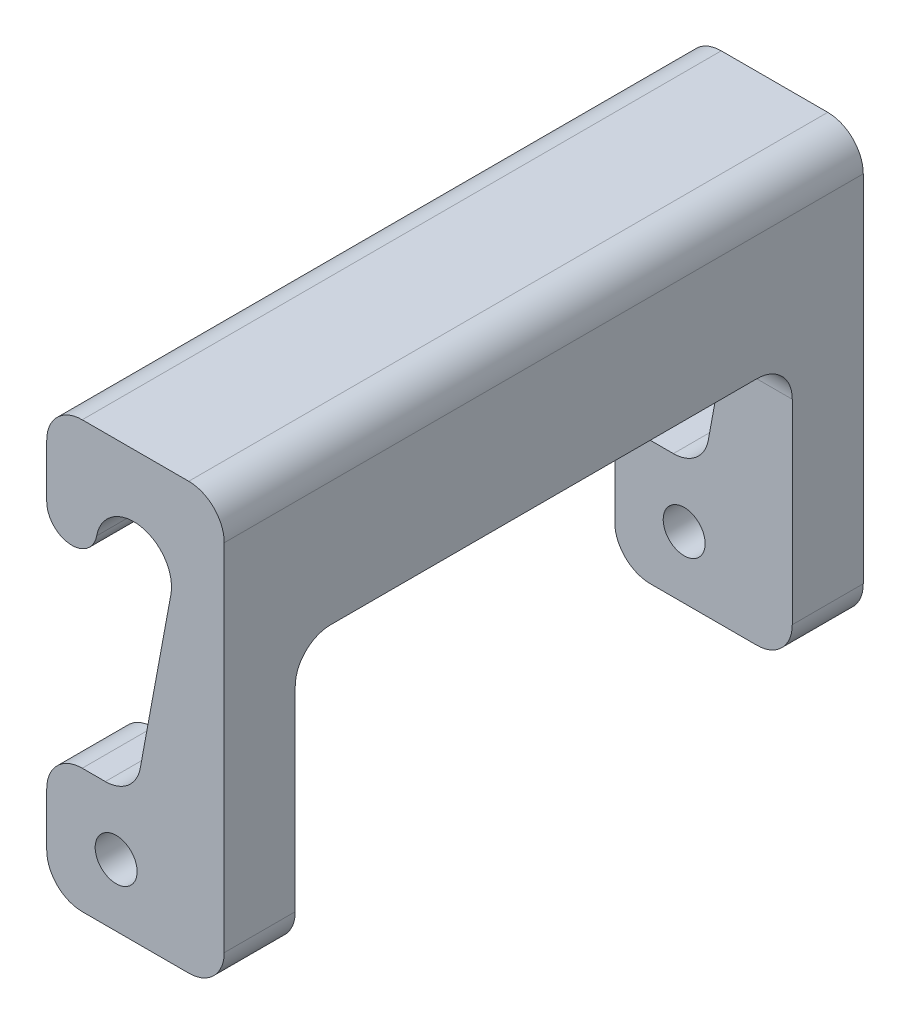
ISO-10303-21;
HEADER;
FILE_DESCRIPTION(('STEP AP214'),'2;1');
FILE_NAME('part.step','',(''),(''),'','','');
FILE_SCHEMA(('AUTOMOTIVE_DESIGN { 1 0 10303 214 1 1 1 1 }'));
ENDSEC;
DATA;
#1=APPLICATION_CONTEXT('core data for automotive mechanical design processes');
#2=APPLICATION_PROTOCOL_DEFINITION('international standard','automotive_design',2000,#1);
#3=PRODUCT_CONTEXT('',#1,'mechanical');
#4=PRODUCT('Part','Part','',(#3));
#5=PRODUCT_RELATED_PRODUCT_CATEGORY('part','',(#4));
#6=PRODUCT_DEFINITION_FORMATION('','',#4);
#7=PRODUCT_DEFINITION_CONTEXT('part definition',#1,'design');
#8=PRODUCT_DEFINITION('design','',#6,#7);
#9=PRODUCT_DEFINITION_SHAPE('','',#8);
#10=(LENGTH_UNIT() NAMED_UNIT(*) SI_UNIT(.MILLI.,.METRE.));
#11=(NAMED_UNIT(*) PLANE_ANGLE_UNIT() SI_UNIT($,.RADIAN.));
#12=(NAMED_UNIT(*) SI_UNIT($,.STERADIAN.) SOLID_ANGLE_UNIT());
#13=UNCERTAINTY_MEASURE_WITH_UNIT(LENGTH_MEASURE(1.E-05),#10,'distance_accuracy_value','');
#14=(GEOMETRIC_REPRESENTATION_CONTEXT(3) GLOBAL_UNCERTAINTY_ASSIGNED_CONTEXT((#13)) GLOBAL_UNIT_ASSIGNED_CONTEXT((#10,
#11,#12)) REPRESENTATION_CONTEXT('',''));
#15=CARTESIAN_POINT('',(0.,0.,0.));
#16=DIRECTION('',(0.,0.,1.));
#17=DIRECTION('',(1.,0.,0.));
#18=AXIS2_PLACEMENT_3D('',#15,#16,#17);
#19=CARTESIAN_POINT('',(0.,8.89,45.72));
#20=DIRECTION('',(0.,-1.,0.));
#21=DIRECTION('',(0.,0.,-1.));
#22=AXIS2_PLACEMENT_3D('',#19,#20,#21);
#23=PLANE('',#22);
#24=DIRECTION('',(0.,0.,-1.));
#25=VECTOR('',#24,1.);
#26=CARTESIAN_POINT('',(4.19391314965813,8.89,45.72));
#27=LINE('',#26,#25);
#28=CARTESIAN_POINT('',(4.19391314965813,8.89,45.72));
#29=VERTEX_POINT('',#28);
#30=CARTESIAN_POINT('',(4.19391314965813,8.89,40.64));
#31=VERTEX_POINT('',#30);
#32=EDGE_CURVE('E237',#29,#31,#27,.T.);
#33=ORIENTED_EDGE('',*,*,#32,.T.);
#34=DIRECTION('',(-1.,0.,0.));
#35=VECTOR('',#34,1.);
#36=CARTESIAN_POINT('',(0.,8.89,40.64));
#37=LINE('',#36,#35);
#38=CARTESIAN_POINT('',(2.54,8.89,40.64));
#39=VERTEX_POINT('',#38);
#40=EDGE_CURVE('E342',#31,#39,#37,.T.);
#41=ORIENTED_EDGE('',*,*,#40,.T.);
#42=DIRECTION('',(0.,0.,-1.));
#43=VECTOR('',#42,1.);
#44=CARTESIAN_POINT('',(2.54,8.89,45.72));
#45=LINE('',#44,#43);
#46=CARTESIAN_POINT('',(2.54,8.89,45.72));
#47=VERTEX_POINT('',#46);
#48=EDGE_CURVE('E274',#47,#39,#45,.T.);
#49=ORIENTED_EDGE('',*,*,#48,.F.);
#50=DIRECTION('',(-1.,0.,0.));
#51=VECTOR('',#50,1.);
#52=CARTESIAN_POINT('',(0.,8.89,45.72));
#53=LINE('',#52,#51);
#54=EDGE_CURVE('E361',#29,#47,#53,.T.);
#55=ORIENTED_EDGE('',*,*,#54,.F.);
#56=EDGE_LOOP('',(#33,#41,#49,#55));
#57=FACE_BOUND('',#56,.T.);
#58=ADVANCED_FACE('F38',(#57),#23,.F.);
#59=CARTESIAN_POINT('',(2.54,6.35,45.72));
#60=DIRECTION('',(0.,0.,-1.));
#61=DIRECTION('',(-1.,0.,0.));
#62=AXIS2_PLACEMENT_3D('',#59,#60,#61);
#63=CYLINDRICAL_SURFACE('',#62,2.54);
#64=ORIENTED_EDGE('',*,*,#48,.T.);
#65=CARTESIAN_POINT('',(2.54,6.35,40.64));
#66=DIRECTION('',(0.,0.,1.));
#67=DIRECTION('',(1.,0.,0.));
#68=AXIS2_PLACEMENT_3D('',#65,#66,#67);
#69=CIRCLE('',#68,2.54);
#70=CARTESIAN_POINT('',(0.,6.35,40.64));
#71=VERTEX_POINT('',#70);
#72=EDGE_CURVE('E345',#39,#71,#69,.T.);
#73=ORIENTED_EDGE('',*,*,#72,.T.);
#74=DIRECTION('',(0.,0.,-1.));
#75=VECTOR('',#74,1.);
#76=CARTESIAN_POINT('',(0.,6.35,45.72));
#77=LINE('',#76,#75);
#78=CARTESIAN_POINT('',(0.,6.35,45.72));
#79=VERTEX_POINT('',#78);
#80=EDGE_CURVE('E270',#79,#71,#77,.T.);
#81=ORIENTED_EDGE('',*,*,#80,.F.);
#82=CARTESIAN_POINT('',(2.54,6.35,45.72));
#83=DIRECTION('',(0.,0.,1.));
#84=DIRECTION('',(1.,0.,0.));
#85=AXIS2_PLACEMENT_3D('',#82,#83,#84);
#86=CIRCLE('',#85,2.54);
#87=EDGE_CURVE('E126',#47,#79,#86,.T.);
#88=ORIENTED_EDGE('',*,*,#87,.F.);
#89=EDGE_LOOP('',(#64,#73,#81,#88));
#90=FACE_BOUND('',#89,.T.);
#91=ADVANCED_FACE('F412',(#90),#63,.T.);
#92=CARTESIAN_POINT('',(0.,0.,45.72));
#93=DIRECTION('',(-1.,0.,0.));
#94=DIRECTION('',(0.,0.,1.));
#95=AXIS2_PLACEMENT_3D('',#92,#93,#94);
#96=PLANE('',#95);
#97=DIRECTION('',(0.,1.,0.));
#98=VECTOR('',#97,1.);
#99=CARTESIAN_POINT('',(0.,0.,40.64));
#100=LINE('',#99,#98);
#101=CARTESIAN_POINT('',(0.,2.54000000000002,40.64));
#102=VERTEX_POINT('',#101);
#103=EDGE_CURVE('E348',#102,#71,#100,.T.);
#104=ORIENTED_EDGE('',*,*,#103,.F.);
#105=DIRECTION('',(0.,0.,-1.));
#106=VECTOR('',#105,1.);
#107=CARTESIAN_POINT('',(0.,2.54000000000002,45.72));
#108=LINE('',#107,#106);
#109=CARTESIAN_POINT('',(0.,2.54000000000002,45.72));
#110=VERTEX_POINT('',#109);
#111=EDGE_CURVE('E266',#110,#102,#108,.T.);
#112=ORIENTED_EDGE('',*,*,#111,.F.);
#113=DIRECTION('',(0.,1.,0.));
#114=VECTOR('',#113,1.);
#115=CARTESIAN_POINT('',(0.,0.,45.72));
#116=LINE('',#115,#114);
#117=EDGE_CURVE('E364',#110,#79,#116,.T.);
#118=ORIENTED_EDGE('',*,*,#117,.T.);
#119=ORIENTED_EDGE('',*,*,#80,.T.);
#120=EDGE_LOOP('',(#104,#112,#118,#119));
#121=FACE_BOUND('',#120,.T.);
#122=ADVANCED_FACE('F418',(#121),#96,.T.);
#123=CARTESIAN_POINT('',(2.54,2.54,45.72));
#124=DIRECTION('',(0.,0.,-1.));
#125=DIRECTION('',(-1.,0.,0.));
#126=AXIS2_PLACEMENT_3D('',#123,#124,#125);
#127=CYLINDRICAL_SURFACE('',#126,2.54);
#128=CARTESIAN_POINT('',(2.54,2.54,40.64));
#129=DIRECTION('',(0.,0.,1.));
#130=DIRECTION('',(1.,0.,0.));
#131=AXIS2_PLACEMENT_3D('',#128,#129,#130);
#132=CIRCLE('',#131,2.54);
#133=CARTESIAN_POINT('',(2.54000000000002,0.,40.64));
#134=VERTEX_POINT('',#133);
#135=EDGE_CURVE('E351',#134,#102,#132,.F.);
#136=ORIENTED_EDGE('',*,*,#135,.F.);
#137=DIRECTION('',(0.,0.,-1.));
#138=VECTOR('',#137,1.);
#139=CARTESIAN_POINT('',(2.54000000000002,0.,45.72));
#140=LINE('',#139,#138);
#141=CARTESIAN_POINT('',(2.54000000000002,0.,45.72));
#142=VERTEX_POINT('',#141);
#143=EDGE_CURVE('E262',#142,#134,#140,.T.);
#144=ORIENTED_EDGE('',*,*,#143,.F.);
#145=CARTESIAN_POINT('',(2.54,2.54,45.72));
#146=DIRECTION('',(0.,0.,1.));
#147=DIRECTION('',(1.,0.,0.));
#148=AXIS2_PLACEMENT_3D('',#145,#146,#147);
#149=CIRCLE('',#148,2.54);
#150=EDGE_CURVE('E367',#142,#110,#149,.F.);
#151=ORIENTED_EDGE('',*,*,#150,.T.);
#152=ORIENTED_EDGE('',*,*,#111,.T.);
#153=EDGE_LOOP('',(#136,#144,#151,#152));
#154=FACE_BOUND('',#153,.T.);
#155=ADVANCED_FACE('F483',(#154),#127,.T.);
#156=CARTESIAN_POINT('',(0.,0.,45.72));
#157=DIRECTION('',(0.,1.,0.));
#158=DIRECTION('',(0.,0.,1.));
#159=AXIS2_PLACEMENT_3D('',#156,#157,#158);
#160=PLANE('',#159);
#161=ORIENTED_EDGE('',*,*,#143,.T.);
#162=DIRECTION('',(1.,0.,0.));
#163=VECTOR('',#162,1.);
#164=CARTESIAN_POINT('',(-12.7,0.,40.64));
#165=LINE('',#164,#163);
#166=CARTESIAN_POINT('',(10.16,0.,40.64));
#167=VERTEX_POINT('',#166);
#168=EDGE_CURVE('E318',#134,#167,#165,.T.);
#169=ORIENTED_EDGE('',*,*,#168,.T.);
#170=DIRECTION('',(0.,0.,-1.));
#171=VECTOR('',#170,1.);
#172=CARTESIAN_POINT('',(10.16,0.,45.72));
#173=LINE('',#172,#171);
#174=CARTESIAN_POINT('',(10.16,0.,45.72));
#175=VERTEX_POINT('',#174);
#176=EDGE_CURVE('E258',#175,#167,#173,.T.);
#177=ORIENTED_EDGE('',*,*,#176,.F.);
#178=DIRECTION('',(1.,0.,0.));
#179=VECTOR('',#178,1.);
#180=CARTESIAN_POINT('',(0.,0.,45.72));
#181=LINE('',#180,#179);
#182=EDGE_CURVE('E370',#142,#175,#181,.T.);
#183=ORIENTED_EDGE('',*,*,#182,.F.);
#184=EDGE_LOOP('',(#161,#169,#177,#183));
#185=FACE_BOUND('',#184,.T.);
#186=ADVANCED_FACE('F684',(#185),#160,.F.);
#187=CARTESIAN_POINT('',(10.16,2.54,45.72));
#188=DIRECTION('',(0.,0.,-1.));
#189=DIRECTION('',(-1.,0.,0.));
#190=AXIS2_PLACEMENT_3D('',#187,#188,#189);
#191=CYLINDRICAL_SURFACE('',#190,2.54);
#192=ORIENTED_EDGE('',*,*,#176,.T.);
#193=CARTESIAN_POINT('',(10.16,2.54,40.64));
#194=DIRECTION('',(0.,0.,1.));
#195=DIRECTION('',(1.,0.,0.));
#196=AXIS2_PLACEMENT_3D('',#193,#194,#195);
#197=CIRCLE('',#196,2.54);
#198=CARTESIAN_POINT('',(12.7,2.54000000000002,40.64));
#199=VERTEX_POINT('',#198);
#200=EDGE_CURVE('E197',#167,#199,#197,.T.);
#201=ORIENTED_EDGE('',*,*,#200,.T.);
#202=DIRECTION('',(0.,0.,-1.));
#203=VECTOR('',#202,1.);
#204=CARTESIAN_POINT('',(12.7,2.54000000000002,45.72));
#205=LINE('',#204,#203);
#206=CARTESIAN_POINT('',(12.7,2.54000000000002,45.72));
#207=VERTEX_POINT('',#206);
#208=EDGE_CURVE('E254',#207,#199,#205,.T.);
#209=ORIENTED_EDGE('',*,*,#208,.F.);
#210=CARTESIAN_POINT('',(10.16,2.54,45.72));
#211=DIRECTION('',(0.,0.,1.));
#212=DIRECTION('',(1.,0.,0.));
#213=AXIS2_PLACEMENT_3D('',#210,#211,#212);
#214=CIRCLE('',#213,2.54);
#215=EDGE_CURVE('E372',#175,#207,#214,.T.);
#216=ORIENTED_EDGE('',*,*,#215,.F.);
#217=EDGE_LOOP('',(#192,#201,#209,#216));
#218=FACE_BOUND('',#217,.T.);
#219=ADVANCED_FACE('F509',(#218),#191,.T.);
#220=CARTESIAN_POINT('',(4.96545990115376,4.445,45.72));
#221=DIRECTION('',(0.,0.,-1.));
#222=DIRECTION('',(-1.,0.,0.));
#223=AXIS2_PLACEMENT_3D('',#220,#221,#222);
#224=CYLINDRICAL_SURFACE('',#223,1.5);
#225=CARTESIAN_POINT('',(4.96545990115376,4.445,40.64));
#226=DIRECTION('',(0.,0.,1.));
#227=DIRECTION('',(1.,0.,0.));
#228=AXIS2_PLACEMENT_3D('',#225,#226,#227);
#229=CIRCLE('',#228,1.5);
#230=CARTESIAN_POINT('',(6.46545990115376,4.445,40.64));
#231=VERTEX_POINT('',#230);
#232=EDGE_CURVE('E354',#231,#231,#229,.T.);
#233=ORIENTED_EDGE('',*,*,#232,.F.);
#234=EDGE_LOOP('',(#233));
#235=FACE_BOUND('',#234,.T.);
#236=CARTESIAN_POINT('',(4.96545990115376,4.445,45.72));
#237=DIRECTION('',(0.,0.,1.));
#238=DIRECTION('',(1.,0.,0.));
#239=AXIS2_PLACEMENT_3D('',#236,#237,#238);
#240=CIRCLE('',#239,1.5);
#241=CARTESIAN_POINT('',(6.46545990115376,4.445,45.72));
#242=VERTEX_POINT('',#241);
#243=EDGE_CURVE('E236',#242,#242,#240,.T.);
#244=ORIENTED_EDGE('',*,*,#243,.T.);
#245=EDGE_LOOP('',(#244));
#246=FACE_BOUND('',#245,.T.);
#247=ADVANCED_FACE('F429',(#235,#246),#224,.F.);
#248=CARTESIAN_POINT('',(4.19391314965813,11.43,45.72));
#249=DIRECTION('',(0.,0.,-1.));
#250=DIRECTION('',(-1.,0.,0.));
#251=AXIS2_PLACEMENT_3D('',#248,#249,#250);
#252=CYLINDRICAL_SURFACE('',#251,2.54);
#253=DIRECTION('',(0.,0.,-1.));
#254=VECTOR('',#253,1.);
#255=CARTESIAN_POINT('',(6.69161647701009,10.9683961779459,45.72));
#256=LINE('',#255,#254);
#257=CARTESIAN_POINT('',(6.69161647701009,10.9683961779459,45.72));
#258=VERTEX_POINT('',#257);
#259=CARTESIAN_POINT('',(6.6916164770101,10.9683961779459,40.64));
#260=VERTEX_POINT('',#259);
#261=EDGE_CURVE('E184',#258,#260,#256,.T.);
#262=ORIENTED_EDGE('',*,*,#261,.T.);
#263=CARTESIAN_POINT('',(4.19391314965813,11.43,40.64));
#264=DIRECTION('',(0.,0.,1.));
#265=DIRECTION('',(1.,0.,0.));
#266=AXIS2_PLACEMENT_3D('',#263,#264,#265);
#267=CIRCLE('',#266,2.54);
#268=EDGE_CURVE('E278',#260,#31,#267,.F.);
#269=ORIENTED_EDGE('',*,*,#268,.T.);
#270=ORIENTED_EDGE('',*,*,#32,.F.);
#271=CARTESIAN_POINT('',(4.19391314965813,11.43,45.72));
#272=DIRECTION('',(0.,0.,1.));
#273=DIRECTION('',(1.,0.,0.));
#274=AXIS2_PLACEMENT_3D('',#271,#272,#273);
#275=CIRCLE('',#274,2.54);
#276=EDGE_CURVE('E62',#258,#29,#275,.F.);
#277=ORIENTED_EDGE('',*,*,#276,.F.);
#278=EDGE_LOOP('',(#262,#269,#270,#277));
#279=FACE_BOUND('',#278,.T.);
#280=ADVANCED_FACE('F422',(#279),#252,.F.);
#281=CARTESIAN_POINT('',(2.54,8.89,5.08));
#282=VERTEX_POINT('',#281);
#283=CARTESIAN_POINT('',(2.54,8.89,0.));
#284=VERTEX_POINT('',#283);
#285=EDGE_CURVE('E273',#282,#284,#45,.T.);
#286=ORIENTED_EDGE('',*,*,#285,.F.);
#287=DIRECTION('',(1.,0.,0.));
#288=VECTOR('',#287,1.);
#289=CARTESIAN_POINT('',(0.,8.89,5.08));
#290=LINE('',#289,#288);
#291=CARTESIAN_POINT('',(4.19391314965813,8.89,5.08));
#292=VERTEX_POINT('',#291);
#293=EDGE_CURVE('E323',#282,#292,#290,.T.);
#294=ORIENTED_EDGE('',*,*,#293,.T.);
#295=CARTESIAN_POINT('',(4.19391314965813,8.89,0.));
#296=VERTEX_POINT('',#295);
#297=EDGE_CURVE('E117',#292,#296,#27,.T.);
#298=ORIENTED_EDGE('',*,*,#297,.T.);
#299=DIRECTION('',(-1.,0.,0.));
#300=VECTOR('',#299,1.);
#301=CARTESIAN_POINT('',(0.,8.89,0.));
#302=LINE('',#301,#300);
#303=EDGE_CURVE('E196',#296,#284,#302,.T.);
#304=ORIENTED_EDGE('',*,*,#303,.T.);
#305=EDGE_LOOP('',(#286,#294,#298,#304));
#306=FACE_BOUND('',#305,.T.);
#307=ADVANCED_FACE('F414',(#306),#23,.F.);
#308=CARTESIAN_POINT('',(0.,6.35,5.08));
#309=VERTEX_POINT('',#308);
#310=CARTESIAN_POINT('',(0.,6.35,0.));
#311=VERTEX_POINT('',#310);
#312=EDGE_CURVE('E269',#309,#311,#77,.T.);
#313=ORIENTED_EDGE('',*,*,#312,.F.);
#314=CARTESIAN_POINT('',(2.54,6.35,5.08));
#315=DIRECTION('',(0.,0.,-1.));
#316=DIRECTION('',(0.,1.,0.));
#317=AXIS2_PLACEMENT_3D('',#314,#315,#316);
#318=CIRCLE('',#317,2.54);
#319=EDGE_CURVE('E325',#309,#282,#318,.T.);
#320=ORIENTED_EDGE('',*,*,#319,.T.);
#321=ORIENTED_EDGE('',*,*,#285,.T.);
#322=CARTESIAN_POINT('',(2.54,6.35,0.));
#323=DIRECTION('',(0.,0.,1.));
#324=DIRECTION('',(1.,0.,0.));
#325=AXIS2_PLACEMENT_3D('',#322,#323,#324);
#326=CIRCLE('',#325,2.54);
#327=EDGE_CURVE('E199',#284,#311,#326,.T.);
#328=ORIENTED_EDGE('',*,*,#327,.T.);
#329=EDGE_LOOP('',(#313,#320,#321,#328));
#330=FACE_BOUND('',#329,.T.);
#331=ADVANCED_FACE('F420',(#330),#63,.T.);
#332=DIRECTION('',(0.,-1.,0.));
#333=VECTOR('',#332,1.);
#334=CARTESIAN_POINT('',(0.,0.,5.08));
#335=LINE('',#334,#333);
#336=CARTESIAN_POINT('',(0.,2.54000000000002,5.08));
#337=VERTEX_POINT('',#336);
#338=EDGE_CURVE('E328',#309,#337,#335,.T.);
#339=ORIENTED_EDGE('',*,*,#338,.F.);
#340=ORIENTED_EDGE('',*,*,#312,.T.);
#341=DIRECTION('',(0.,1.,0.));
#342=VECTOR('',#341,1.);
#343=CARTESIAN_POINT('',(0.,0.,0.));
#344=LINE('',#343,#342);
#345=CARTESIAN_POINT('',(0.,2.54000000000002,0.));
#346=VERTEX_POINT('',#345);
#347=EDGE_CURVE('E202',#346,#311,#344,.T.);
#348=ORIENTED_EDGE('',*,*,#347,.F.);
#349=EDGE_CURVE('E265',#337,#346,#108,.T.);
#350=ORIENTED_EDGE('',*,*,#349,.F.);
#351=EDGE_LOOP('',(#339,#340,#348,#350));
#352=FACE_BOUND('',#351,.T.);
#353=ADVANCED_FACE('F427',(#352),#96,.T.);
#354=CARTESIAN_POINT('',(2.54,2.54,5.08));
#355=DIRECTION('',(0.,0.,-1.));
#356=DIRECTION('',(0.,1.,0.));
#357=AXIS2_PLACEMENT_3D('',#354,#355,#356);
#358=CIRCLE('',#357,2.54);
#359=CARTESIAN_POINT('',(2.54000000000002,0.,5.08));
#360=VERTEX_POINT('',#359);
#361=EDGE_CURVE('E331',#337,#360,#358,.F.);
#362=ORIENTED_EDGE('',*,*,#361,.F.);
#363=ORIENTED_EDGE('',*,*,#349,.T.);
#364=CARTESIAN_POINT('',(2.54,2.54,0.));
#365=DIRECTION('',(0.,0.,1.));
#366=DIRECTION('',(1.,0.,0.));
#367=AXIS2_PLACEMENT_3D('',#364,#365,#366);
#368=CIRCLE('',#367,2.54);
#369=CARTESIAN_POINT('',(2.54000000000002,0.,0.));
#370=VERTEX_POINT('',#369);
#371=EDGE_CURVE('E205',#370,#346,#368,.F.);
#372=ORIENTED_EDGE('',*,*,#371,.F.);
#373=EDGE_CURVE('E261',#360,#370,#140,.T.);
#374=ORIENTED_EDGE('',*,*,#373,.F.);
#375=EDGE_LOOP('',(#362,#363,#372,#374));
#376=FACE_BOUND('',#375,.T.);
#377=ADVANCED_FACE('F531',(#376),#127,.T.);
#378=CARTESIAN_POINT('',(10.16,0.,5.08));
#379=VERTEX_POINT('',#378);
#380=CARTESIAN_POINT('',(10.16,0.,0.));
#381=VERTEX_POINT('',#380);
#382=EDGE_CURVE('E257',#379,#381,#173,.T.);
#383=ORIENTED_EDGE('',*,*,#382,.F.);
#384=DIRECTION('',(1.,0.,0.));
#385=VECTOR('',#384,1.);
#386=CARTESIAN_POINT('',(-12.7,0.,5.08));
#387=LINE('',#386,#385);
#388=EDGE_CURVE('E312',#360,#379,#387,.T.);
#389=ORIENTED_EDGE('',*,*,#388,.F.);
#390=ORIENTED_EDGE('',*,*,#373,.T.);
#391=DIRECTION('',(1.,0.,0.));
#392=VECTOR('',#391,1.);
#393=CARTESIAN_POINT('',(0.,0.,0.));
#394=LINE('',#393,#392);
#395=EDGE_CURVE('E208',#370,#381,#394,.T.);
#396=ORIENTED_EDGE('',*,*,#395,.T.);
#397=EDGE_LOOP('',(#383,#389,#390,#396));
#398=FACE_BOUND('',#397,.T.);
#399=ADVANCED_FACE('F538',(#398),#160,.F.);
#400=CARTESIAN_POINT('',(12.7,2.54000000000002,5.08));
#401=VERTEX_POINT('',#400);
#402=CARTESIAN_POINT('',(12.7,2.54000000000002,0.));
#403=VERTEX_POINT('',#402);
#404=EDGE_CURVE('E253',#401,#403,#205,.T.);
#405=ORIENTED_EDGE('',*,*,#404,.F.);
#406=CARTESIAN_POINT('',(10.16,2.54,5.08));
#407=DIRECTION('',(0.,0.,-1.));
#408=DIRECTION('',(0.,1.,0.));
#409=AXIS2_PLACEMENT_3D('',#406,#407,#408);
#410=CIRCLE('',#409,2.54);
#411=EDGE_CURVE('E337',#401,#379,#410,.T.);
#412=ORIENTED_EDGE('',*,*,#411,.T.);
#413=ORIENTED_EDGE('',*,*,#382,.T.);
#414=CARTESIAN_POINT('',(10.16,2.54,0.));
#415=DIRECTION('',(0.,0.,1.));
#416=DIRECTION('',(1.,0.,0.));
#417=AXIS2_PLACEMENT_3D('',#414,#415,#416);
#418=CIRCLE('',#417,2.54);
#419=EDGE_CURVE('E211',#381,#403,#418,.T.);
#420=ORIENTED_EDGE('',*,*,#419,.T.);
#421=EDGE_LOOP('',(#405,#412,#413,#420));
#422=FACE_BOUND('',#421,.T.);
#423=ADVANCED_FACE('F525',(#422),#191,.T.);
#424=CARTESIAN_POINT('',(12.7,0.,45.72));
#425=DIRECTION('',(-1.,0.,0.));
#426=DIRECTION('',(0.,0.,1.));
#427=AXIS2_PLACEMENT_3D('',#424,#425,#426);
#428=PLANE('',#427);
#429=ORIENTED_EDGE('',*,*,#208,.T.);
#430=DIRECTION('',(0.,-1.,0.));
#431=VECTOR('',#430,1.);
#432=CARTESIAN_POINT('',(12.7,0.,40.64));
#433=LINE('',#432,#431);
#434=CARTESIAN_POINT('',(12.7,16.51,40.64));
#435=VERTEX_POINT('',#434);
#436=EDGE_CURVE('E505',#435,#199,#433,.T.);
#437=ORIENTED_EDGE('',*,*,#436,.F.);
#438=CARTESIAN_POINT('',(12.7,16.51,38.1));
#439=DIRECTION('',(1.,0.,0.));
#440=DIRECTION('',(0.,0.,1.));
#441=AXIS2_PLACEMENT_3D('',#438,#439,#440);
#442=CIRCLE('',#441,2.54);
#443=CARTESIAN_POINT('',(12.7,19.05,38.1));
#444=VERTEX_POINT('',#443);
#445=EDGE_CURVE('E321',#444,#435,#442,.T.);
#446=ORIENTED_EDGE('',*,*,#445,.F.);
#447=DIRECTION('',(0.,0.,1.));
#448=VECTOR('',#447,1.);
#449=CARTESIAN_POINT('',(12.7,19.05,38.1));
#450=LINE('',#449,#448);
#451=CARTESIAN_POINT('',(12.7,19.05,7.62));
#452=VERTEX_POINT('',#451);
#453=EDGE_CURVE('E499',#452,#444,#450,.T.);
#454=ORIENTED_EDGE('',*,*,#453,.F.);
#455=CARTESIAN_POINT('',(12.7,16.51,7.62));
#456=DIRECTION('',(1.,0.,0.));
#457=DIRECTION('',(0.,0.,1.));
#458=AXIS2_PLACEMENT_3D('',#455,#456,#457);
#459=CIRCLE('',#458,2.54);
#460=CARTESIAN_POINT('',(12.7,16.51,5.08));
#461=VERTEX_POINT('',#460);
#462=EDGE_CURVE('E306',#461,#452,#459,.T.);
#463=ORIENTED_EDGE('',*,*,#462,.F.);
#464=DIRECTION('',(0.,1.,0.));
#465=VECTOR('',#464,1.);
#466=CARTESIAN_POINT('',(12.7,0.,5.08));
#467=LINE('',#466,#465);
#468=EDGE_CURVE('E502',#401,#461,#467,.T.);
#469=ORIENTED_EDGE('',*,*,#468,.F.);
#470=ORIENTED_EDGE('',*,*,#404,.T.);
#471=DIRECTION('',(0.,1.,0.));
#472=VECTOR('',#471,1.);
#473=CARTESIAN_POINT('',(12.7,0.,0.));
#474=LINE('',#473,#472);
#475=CARTESIAN_POINT('',(12.7,27.94,0.));
#476=VERTEX_POINT('',#475);
#477=EDGE_CURVE('E214',#403,#476,#474,.T.);
#478=ORIENTED_EDGE('',*,*,#477,.T.);
#479=DIRECTION('',(0.,0.,-1.));
#480=VECTOR('',#479,1.);
#481=CARTESIAN_POINT('',(12.7,27.94,45.72));
#482=LINE('',#481,#480);
#483=CARTESIAN_POINT('',(12.7,27.94,45.72));
#484=VERTEX_POINT('',#483);
#485=EDGE_CURVE('E251',#484,#476,#482,.T.);
#486=ORIENTED_EDGE('',*,*,#485,.F.);
#487=DIRECTION('',(0.,1.,0.));
#488=VECTOR('',#487,1.);
#489=CARTESIAN_POINT('',(12.7,0.,45.72));
#490=LINE('',#489,#488);
#491=EDGE_CURVE('E374',#207,#484,#490,.T.);
#492=ORIENTED_EDGE('',*,*,#491,.F.);
#493=EDGE_LOOP('',(#429,#437,#446,#454,#463,#469,#470,#478,#486,#492));
#494=FACE_BOUND('',#493,.T.);
#495=ADVANCED_FACE('F512',(#494),#428,.F.);
#496=CARTESIAN_POINT('',(10.16,27.94,45.72));
#497=DIRECTION('',(0.,0.,-1.));
#498=DIRECTION('',(-1.,0.,0.));
#499=AXIS2_PLACEMENT_3D('',#496,#497,#498);
#500=CYLINDRICAL_SURFACE('',#499,2.54);
#501=CARTESIAN_POINT('',(10.16,27.94,0.));
#502=DIRECTION('',(0.,0.,1.));
#503=DIRECTION('',(1.,0.,0.));
#504=AXIS2_PLACEMENT_3D('',#501,#502,#503);
#505=CIRCLE('',#504,2.54);
#506=CARTESIAN_POINT('',(10.16,30.48,0.));
#507=VERTEX_POINT('',#506);
#508=EDGE_CURVE('E217',#507,#476,#505,.F.);
#509=ORIENTED_EDGE('',*,*,#508,.F.);
#510=DIRECTION('',(0.,0.,-1.));
#511=VECTOR('',#510,1.);
#512=CARTESIAN_POINT('',(10.16,30.48,45.72));
#513=LINE('',#512,#511);
#514=CARTESIAN_POINT('',(10.16,30.48,45.72));
#515=VERTEX_POINT('',#514);
#516=EDGE_CURVE('E249',#515,#507,#513,.T.);
#517=ORIENTED_EDGE('',*,*,#516,.F.);
#518=CARTESIAN_POINT('',(10.16,27.94,45.72));
#519=DIRECTION('',(0.,0.,1.));
#520=DIRECTION('',(1.,0.,0.));
#521=AXIS2_PLACEMENT_3D('',#518,#519,#520);
#522=CIRCLE('',#521,2.54);
#523=EDGE_CURVE('E376',#515,#484,#522,.F.);
#524=ORIENTED_EDGE('',*,*,#523,.T.);
#525=ORIENTED_EDGE('',*,*,#485,.T.);
#526=EDGE_LOOP('',(#509,#517,#524,#525));
#527=FACE_BOUND('',#526,.T.);
#528=ADVANCED_FACE('F520',(#527),#500,.T.);
#529=CARTESIAN_POINT('',(0.,30.48,45.72));
#530=DIRECTION('',(0.,1.,0.));
#531=DIRECTION('',(0.,0.,1.));
#532=AXIS2_PLACEMENT_3D('',#529,#530,#531);
#533=PLANE('',#532);
#534=DIRECTION('',(1.,0.,0.));
#535=VECTOR('',#534,1.);
#536=CARTESIAN_POINT('',(0.,30.48,0.));
#537=LINE('',#536,#535);
#538=CARTESIAN_POINT('',(2.54,30.48,0.));
#539=VERTEX_POINT('',#538);
#540=EDGE_CURVE('E220',#539,#507,#537,.T.);
#541=ORIENTED_EDGE('',*,*,#540,.F.);
#542=DIRECTION('',(0.,0.,-1.));
#543=VECTOR('',#542,1.);
#544=CARTESIAN_POINT('',(2.54,30.48,45.72));
#545=LINE('',#544,#543);
#546=CARTESIAN_POINT('',(2.54,30.48,45.72));
#547=VERTEX_POINT('',#546);
#548=EDGE_CURVE('E247',#547,#539,#545,.T.);
#549=ORIENTED_EDGE('',*,*,#548,.F.);
#550=DIRECTION('',(1.,0.,0.));
#551=VECTOR('',#550,1.);
#552=CARTESIAN_POINT('',(0.,30.48,45.72));
#553=LINE('',#552,#551);
#554=EDGE_CURVE('E379',#547,#515,#553,.T.);
#555=ORIENTED_EDGE('',*,*,#554,.T.);
#556=ORIENTED_EDGE('',*,*,#516,.T.);
#557=EDGE_LOOP('',(#541,#549,#555,#556));
#558=FACE_BOUND('',#557,.T.);
#559=ADVANCED_FACE('F516',(#558),#533,.T.);
#560=CARTESIAN_POINT('',(2.54,27.94,45.72));
#561=DIRECTION('',(0.,0.,-1.));
#562=DIRECTION('',(-1.,0.,0.));
#563=AXIS2_PLACEMENT_3D('',#560,#561,#562);
#564=CYLINDRICAL_SURFACE('',#563,2.54);
#565=CARTESIAN_POINT('',(2.54,27.94,0.));
#566=DIRECTION('',(0.,0.,1.));
#567=DIRECTION('',(1.,0.,0.));
#568=AXIS2_PLACEMENT_3D('',#565,#566,#567);
#569=CIRCLE('',#568,2.54);
#570=CARTESIAN_POINT('',(0.,27.94,0.));
#571=VERTEX_POINT('',#570);
#572=EDGE_CURVE('E223',#571,#539,#569,.F.);
#573=ORIENTED_EDGE('',*,*,#572,.F.);
#574=DIRECTION('',(0.,0.,-1.));
#575=VECTOR('',#574,1.);
#576=CARTESIAN_POINT('',(0.,27.94,45.72));
#577=LINE('',#576,#575);
#578=CARTESIAN_POINT('',(0.,27.94,45.72));
#579=VERTEX_POINT('',#578);
#580=EDGE_CURVE('E245',#579,#571,#577,.T.);
#581=ORIENTED_EDGE('',*,*,#580,.F.);
#582=CARTESIAN_POINT('',(2.54,27.94,45.72));
#583=DIRECTION('',(0.,0.,1.));
#584=DIRECTION('',(1.,0.,0.));
#585=AXIS2_PLACEMENT_3D('',#582,#583,#584);
#586=CIRCLE('',#585,2.54);
#587=EDGE_CURVE('E382',#579,#547,#586,.F.);
#588=ORIENTED_EDGE('',*,*,#587,.T.);
#589=ORIENTED_EDGE('',*,*,#548,.T.);
#590=EDGE_LOOP('',(#573,#581,#588,#589));
#591=FACE_BOUND('',#590,.T.);
#592=ADVANCED_FACE('F395',(#591),#564,.T.);
#593=CARTESIAN_POINT('',(0.,0.,45.72));
#594=DIRECTION('',(-1.,0.,0.));
#595=DIRECTION('',(0.,0.,1.));
#596=AXIS2_PLACEMENT_3D('',#593,#594,#595);
#597=PLANE('',#596);
#598=DIRECTION('',(0.,1.,0.));
#599=VECTOR('',#598,1.);
#600=CARTESIAN_POINT('',(0.,0.,0.));
#601=LINE('',#600,#599);
#602=CARTESIAN_POINT('',(0.,24.13,0.));
#603=VERTEX_POINT('',#602);
#604=EDGE_CURVE('E226',#603,#571,#601,.T.);
#605=ORIENTED_EDGE('',*,*,#604,.F.);
#606=DIRECTION('',(0.,0.,-1.));
#607=VECTOR('',#606,1.);
#608=CARTESIAN_POINT('',(0.,24.13,45.72));
#609=LINE('',#608,#607);
#610=CARTESIAN_POINT('',(0.,24.13,45.72));
#611=VERTEX_POINT('',#610);
#612=EDGE_CURVE('E243',#611,#603,#609,.T.);
#613=ORIENTED_EDGE('',*,*,#612,.F.);
#614=DIRECTION('',(0.,1.,0.));
#615=VECTOR('',#614,1.);
#616=CARTESIAN_POINT('',(0.,0.,45.72));
#617=LINE('',#616,#615);
#618=EDGE_CURVE('E385',#611,#579,#617,.T.);
#619=ORIENTED_EDGE('',*,*,#618,.T.);
#620=ORIENTED_EDGE('',*,*,#580,.T.);
#621=EDGE_LOOP('',(#605,#613,#619,#620));
#622=FACE_BOUND('',#621,.T.);
#623=ADVANCED_FACE('F389',(#622),#597,.T.);
#624=CARTESIAN_POINT('',(1.80078185572796,24.13,45.72));
#625=DIRECTION('',(0.,0.,-1.));
#626=DIRECTION('',(-1.,0.,0.));
#627=AXIS2_PLACEMENT_3D('',#624,#625,#626);
#628=CYLINDRICAL_SURFACE('',#627,1.80078185572796);
#629=CARTESIAN_POINT('',(1.80078185572796,24.13,0.));
#630=DIRECTION('',(0.,0.,1.));
#631=DIRECTION('',(1.,0.,0.));
#632=AXIS2_PLACEMENT_3D('',#629,#630,#631);
#633=CIRCLE('',#632,1.80078185572796);
#634=CARTESIAN_POINT('',(3.57157667182511,23.8027370916182,0.));
#635=VERTEX_POINT('',#634);
#636=EDGE_CURVE('E229',#603,#635,#633,.T.);
#637=ORIENTED_EDGE('',*,*,#636,.T.);
#638=DIRECTION('',(0.,0.,-1.));
#639=VECTOR('',#638,1.);
#640=CARTESIAN_POINT('',(3.57157667182511,23.8027370916182,45.72));
#641=LINE('',#640,#639);
#642=CARTESIAN_POINT('',(3.57157667182511,23.8027370916182,45.72));
#643=VERTEX_POINT('',#642);
#644=EDGE_CURVE('E183',#643,#635,#641,.T.);
#645=ORIENTED_EDGE('',*,*,#644,.F.);
#646=CARTESIAN_POINT('',(1.80078185572796,24.13,45.72));
#647=DIRECTION('',(0.,0.,1.));
#648=DIRECTION('',(1.,0.,0.));
#649=AXIS2_PLACEMENT_3D('',#646,#647,#648);
#650=CIRCLE('',#649,1.80078185572796);
#651=EDGE_CURVE('E170',#611,#643,#650,.T.);
#652=ORIENTED_EDGE('',*,*,#651,.F.);
#653=ORIENTED_EDGE('',*,*,#612,.T.);
#654=EDGE_LOOP('',(#637,#645,#652,#653));
#655=FACE_BOUND('',#654,.T.);
#656=ADVANCED_FACE('F402',(#655),#628,.T.);
#657=CARTESIAN_POINT('',(6.22687011640835,23.3120088336733,45.72));
#658=DIRECTION('',(0.,0.,-1.));
#659=DIRECTION('',(-1.,0.,0.));
#660=AXIS2_PLACEMENT_3D('',#657,#658,#659);
#661=CYLINDRICAL_SURFACE('',#660,2.7002587838932);
#662=CARTESIAN_POINT('',(6.22687011640835,23.3120088336733,0.));
#663=DIRECTION('',(0.,0.,1.));
#664=DIRECTION('',(1.,0.,0.));
#665=AXIS2_PLACEMENT_3D('',#662,#663,#664);
#666=CIRCLE('',#665,2.7002587838932);
#667=CARTESIAN_POINT('',(8.88216356099158,22.8212805757283,0.));
#668=VERTEX_POINT('',#667);
#669=EDGE_CURVE('E179',#635,#668,#666,.F.);
#670=ORIENTED_EDGE('',*,*,#669,.T.);
#671=DIRECTION('',(0.,0.,-1.));
#672=VECTOR('',#671,1.);
#673=CARTESIAN_POINT('',(8.88216356099158,22.8212805757283,45.72));
#674=LINE('',#673,#672);
#675=CARTESIAN_POINT('',(8.88216356099158,22.8212805757283,45.72));
#676=VERTEX_POINT('',#675);
#677=EDGE_CURVE('E176',#676,#668,#674,.T.);
#678=ORIENTED_EDGE('',*,*,#677,.F.);
#679=CARTESIAN_POINT('',(6.22687011640835,23.3120088336733,45.72));
#680=DIRECTION('',(0.,0.,1.));
#681=DIRECTION('',(1.,0.,0.));
#682=AXIS2_PLACEMENT_3D('',#679,#680,#681);
#683=CIRCLE('',#682,2.7002587838932);
#684=EDGE_CURVE('E162',#643,#676,#683,.F.);
#685=ORIENTED_EDGE('',*,*,#684,.F.);
#686=ORIENTED_EDGE('',*,*,#644,.T.);
#687=EDGE_LOOP('',(#670,#678,#685,#686));
#688=FACE_BOUND('',#687,.T.);
#689=ADVANCED_FACE('F177',(#688),#661,.F.);
#690=CARTESIAN_POINT('',(4.51047650161242,-0.833587067618975,45.72));
#691=DIRECTION('',(0.983347766674,-0.181733788210274,0.));
#692=DIRECTION('',(0.181733788210274,0.983347766674,0.));
#693=AXIS2_PLACEMENT_3D('',#690,#691,#692);
#694=PLANE('',#693);
#695=CARTESIAN_POINT('',(7.71576753472668,16.51,38.1));
#696=DIRECTION('',(0.983347766674,-0.181733788210274,0.));
#697=DIRECTION('',(0.181733788210274,0.983347766674,0.));
#698=AXIS2_PLACEMENT_3D('',#695,#696,#697);
#699=ELLIPSE('',#698,2.58301293406208,2.54);
#700=CARTESIAN_POINT('',(8.18518826022992,19.05,38.1));
#701=VERTEX_POINT('',#700);
#702=CARTESIAN_POINT('',(7.71576753472668,16.51,40.64));
#703=VERTEX_POINT('',#702);
#704=EDGE_CURVE('E11',#701,#703,#699,.T.);
#705=ORIENTED_EDGE('',*,*,#704,.T.);
#706=DIRECTION('',(-0.181733788210274,-0.983347766674,0.));
#707=VECTOR('',#706,1.);
#708=CARTESIAN_POINT('',(4.51047650161242,-0.833587067618975,40.64));
#709=LINE('',#708,#707);
#710=EDGE_CURVE('E340',#703,#260,#709,.T.);
#711=ORIENTED_EDGE('',*,*,#710,.T.);
#712=ORIENTED_EDGE('',*,*,#261,.F.);
#713=DIRECTION('',(-0.181733788210274,-0.983347766674,0.));
#714=VECTOR('',#713,1.);
#715=CARTESIAN_POINT('',(4.51047650161242,-0.833587067618975,45.72));
#716=LINE('',#715,#714);
#717=EDGE_CURVE('E166',#676,#258,#716,.T.);
#718=ORIENTED_EDGE('',*,*,#717,.F.);
#719=ORIENTED_EDGE('',*,*,#677,.T.);
#720=DIRECTION('',(-0.181733788210274,-0.983347766674,0.));
#721=VECTOR('',#720,1.);
#722=CARTESIAN_POINT('',(4.51047650161242,-0.833587067618975,0.));
#723=LINE('',#722,#721);
#724=CARTESIAN_POINT('',(6.69161647701009,10.9683961779459,0.));
#725=VERTEX_POINT('',#724);
#726=EDGE_CURVE('E232',#668,#725,#723,.T.);
#727=ORIENTED_EDGE('',*,*,#726,.T.);
#728=CARTESIAN_POINT('',(6.69161647701009,10.9683961779459,5.08));
#729=VERTEX_POINT('',#728);
#730=EDGE_CURVE('E240',#729,#725,#256,.T.);
#731=ORIENTED_EDGE('',*,*,#730,.F.);
#732=DIRECTION('',(0.181733788210274,0.983347766674,0.));
#733=VECTOR('',#732,1.);
#734=CARTESIAN_POINT('',(4.51047650161242,-0.833587067618979,5.08));
#735=LINE('',#734,#733);
#736=CARTESIAN_POINT('',(7.71576753472668,16.51,5.08));
#737=VERTEX_POINT('',#736);
#738=EDGE_CURVE('E53',#729,#737,#735,.T.);
#739=ORIENTED_EDGE('',*,*,#738,.T.);
#740=CARTESIAN_POINT('',(7.71576753472668,16.51,7.62));
#741=DIRECTION('',(0.983347766674,-0.181733788210274,0.));
#742=DIRECTION('',(0.181733788210274,0.983347766674,0.));
#743=AXIS2_PLACEMENT_3D('',#740,#741,#742);
#744=ELLIPSE('',#743,2.58301293406208,2.54);
#745=CARTESIAN_POINT('',(8.18518826022992,19.05,7.62));
#746=VERTEX_POINT('',#745);
#747=EDGE_CURVE('E281',#737,#746,#744,.T.);
#748=ORIENTED_EDGE('',*,*,#747,.T.);
#749=DIRECTION('',(0.,0.,1.));
#750=VECTOR('',#749,1.);
#751=CARTESIAN_POINT('',(8.18518826022992,19.05,45.72));
#752=LINE('',#751,#750);
#753=EDGE_CURVE('E46',#746,#701,#752,.T.);
#754=ORIENTED_EDGE('',*,*,#753,.T.);
#755=EDGE_LOOP('',(#705,#711,#712,#718,#719,#727,#731,#739,#748,#754));
#756=FACE_BOUND('',#755,.T.);
#757=ADVANCED_FACE('F186',(#756),#694,.F.);
#758=CARTESIAN_POINT('',(4.96545990115376,4.445,5.08));
#759=DIRECTION('',(0.,0.,-1.));
#760=DIRECTION('',(0.,1.,0.));
#761=AXIS2_PLACEMENT_3D('',#758,#759,#760);
#762=CIRCLE('',#761,1.5);
#763=CARTESIAN_POINT('',(4.96545990115376,5.945,5.08));
#764=VERTEX_POINT('',#763);
#765=EDGE_CURVE('E334',#764,#764,#762,.T.);
#766=ORIENTED_EDGE('',*,*,#765,.F.);
#767=EDGE_LOOP('',(#766));
#768=FACE_BOUND('',#767,.T.);
#769=CARTESIAN_POINT('',(4.96545990115376,4.445,0.));
#770=DIRECTION('',(0.,0.,1.));
#771=DIRECTION('',(1.,0.,0.));
#772=AXIS2_PLACEMENT_3D('',#769,#770,#771);
#773=CIRCLE('',#772,1.5);
#774=CARTESIAN_POINT('',(6.46545990115376,4.445,0.));
#775=VERTEX_POINT('',#774);
#776=EDGE_CURVE('E193',#775,#775,#773,.T.);
#777=ORIENTED_EDGE('',*,*,#776,.F.);
#778=EDGE_LOOP('',(#777));
#779=FACE_BOUND('',#778,.T.);
#780=ADVANCED_FACE('F40',(#768,#779),#224,.F.);
#781=ORIENTED_EDGE('',*,*,#297,.F.);
#782=CARTESIAN_POINT('',(4.19391314965813,11.43,5.08));
#783=DIRECTION('',(0.,0.,-1.));
#784=DIRECTION('',(0.,1.,0.));
#785=AXIS2_PLACEMENT_3D('',#782,#783,#784);
#786=CIRCLE('',#785,2.54);
#787=EDGE_CURVE('E276',#292,#729,#786,.F.);
#788=ORIENTED_EDGE('',*,*,#787,.T.);
#789=ORIENTED_EDGE('',*,*,#730,.T.);
#790=CARTESIAN_POINT('',(4.19391314965813,11.43,0.));
#791=DIRECTION('',(0.,0.,1.));
#792=DIRECTION('',(1.,0.,0.));
#793=AXIS2_PLACEMENT_3D('',#790,#791,#792);
#794=CIRCLE('',#793,2.54);
#795=EDGE_CURVE('E234',#725,#296,#794,.F.);
#796=ORIENTED_EDGE('',*,*,#795,.T.);
#797=EDGE_LOOP('',(#781,#788,#789,#796));
#798=FACE_BOUND('',#797,.T.);
#799=ADVANCED_FACE('F432',(#798),#252,.F.);
#800=CARTESIAN_POINT('',(0.,0.,45.72));
#801=DIRECTION('',(0.,0.,1.));
#802=DIRECTION('',(1.,0.,0.));
#803=AXIS2_PLACEMENT_3D('',#800,#801,#802);
#804=PLANE('',#803);
#805=ORIENTED_EDGE('',*,*,#243,.F.);
#806=EDGE_LOOP('',(#805));
#807=FACE_BOUND('',#806,.T.);
#808=ORIENTED_EDGE('',*,*,#54,.T.);
#809=ORIENTED_EDGE('',*,*,#87,.T.);
#810=ORIENTED_EDGE('',*,*,#117,.F.);
#811=ORIENTED_EDGE('',*,*,#150,.F.);
#812=ORIENTED_EDGE('',*,*,#182,.T.);
#813=ORIENTED_EDGE('',*,*,#215,.T.);
#814=ORIENTED_EDGE('',*,*,#491,.T.);
#815=ORIENTED_EDGE('',*,*,#523,.F.);
#816=ORIENTED_EDGE('',*,*,#554,.F.);
#817=ORIENTED_EDGE('',*,*,#587,.F.);
#818=ORIENTED_EDGE('',*,*,#618,.F.);
#819=ORIENTED_EDGE('',*,*,#651,.T.);
#820=ORIENTED_EDGE('',*,*,#684,.T.);
#821=ORIENTED_EDGE('',*,*,#717,.T.);
#822=ORIENTED_EDGE('',*,*,#276,.T.);
#823=EDGE_LOOP('',(#808,#809,#810,#811,#812,#813,#814,#815,#816,#817,#818,#819,#820,#821,#822));
#824=FACE_BOUND('',#823,.T.);
#825=ADVANCED_FACE('F164',(#807,#824),#804,.T.);
#826=CARTESIAN_POINT('',(0.,0.,0.));
#827=DIRECTION('',(0.,0.,1.));
#828=DIRECTION('',(1.,0.,0.));
#829=AXIS2_PLACEMENT_3D('',#826,#827,#828);
#830=PLANE('',#829);
#831=ORIENTED_EDGE('',*,*,#776,.T.);
#832=EDGE_LOOP('',(#831));
#833=FACE_BOUND('',#832,.T.);
#834=ORIENTED_EDGE('',*,*,#303,.F.);
#835=ORIENTED_EDGE('',*,*,#795,.F.);
#836=ORIENTED_EDGE('',*,*,#726,.F.);
#837=ORIENTED_EDGE('',*,*,#669,.F.);
#838=ORIENTED_EDGE('',*,*,#636,.F.);
#839=ORIENTED_EDGE('',*,*,#604,.T.);
#840=ORIENTED_EDGE('',*,*,#572,.T.);
#841=ORIENTED_EDGE('',*,*,#540,.T.);
#842=ORIENTED_EDGE('',*,*,#508,.T.);
#843=ORIENTED_EDGE('',*,*,#477,.F.);
#844=ORIENTED_EDGE('',*,*,#419,.F.);
#845=ORIENTED_EDGE('',*,*,#395,.F.);
#846=ORIENTED_EDGE('',*,*,#371,.T.);
#847=ORIENTED_EDGE('',*,*,#347,.T.);
#848=ORIENTED_EDGE('',*,*,#327,.F.);
#849=EDGE_LOOP('',(#834,#835,#836,#837,#838,#839,#840,#841,#842,#843,#844,#845,#846,#847,#848));
#850=FACE_BOUND('',#849,.T.);
#851=ADVANCED_FACE('F400',(#833,#850),#830,.F.);
#852=CARTESIAN_POINT('',(-12.7,16.51,38.1));
#853=DIRECTION('',(1.,0.,0.));
#854=DIRECTION('',(0.,0.,-1.));
#855=AXIS2_PLACEMENT_3D('',#852,#853,#854);
#856=CYLINDRICAL_SURFACE('',#855,2.54);
#857=DIRECTION('',(1.,0.,0.));
#858=VECTOR('',#857,1.);
#859=CARTESIAN_POINT('',(-12.7,19.05,38.1));
#860=LINE('',#859,#858);
#861=EDGE_CURVE('E299',#701,#444,#860,.T.);
#862=ORIENTED_EDGE('',*,*,#861,.T.);
#863=ORIENTED_EDGE('',*,*,#445,.T.);
#864=DIRECTION('',(1.,0.,0.));
#865=VECTOR('',#864,1.);
#866=CARTESIAN_POINT('',(-12.7,16.51,40.64));
#867=LINE('',#866,#865);
#868=EDGE_CURVE('E310',#703,#435,#867,.T.);
#869=ORIENTED_EDGE('',*,*,#868,.F.);
#870=ORIENTED_EDGE('',*,*,#704,.F.);
#871=EDGE_LOOP('',(#862,#863,#869,#870));
#872=FACE_BOUND('',#871,.T.);
#873=ADVANCED_FACE('F494',(#872),#856,.F.);
#874=CARTESIAN_POINT('',(-12.7,19.05,38.1));
#875=DIRECTION('',(0.,1.,0.));
#876=DIRECTION('',(0.,0.,1.));
#877=AXIS2_PLACEMENT_3D('',#874,#875,#876);
#878=PLANE('',#877);
#879=DIRECTION('',(1.,0.,0.));
#880=VECTOR('',#879,1.);
#881=CARTESIAN_POINT('',(-12.7,19.05,7.62));
#882=LINE('',#881,#880);
#883=EDGE_CURVE('E296',#746,#452,#882,.T.);
#884=ORIENTED_EDGE('',*,*,#883,.T.);
#885=ORIENTED_EDGE('',*,*,#453,.T.);
#886=ORIENTED_EDGE('',*,*,#861,.F.);
#887=ORIENTED_EDGE('',*,*,#753,.F.);
#888=EDGE_LOOP('',(#884,#885,#886,#887));
#889=FACE_BOUND('',#888,.T.);
#890=ADVANCED_FACE('F293',(#889),#878,.F.);
#891=CARTESIAN_POINT('',(-12.7,16.51,7.62));
#892=DIRECTION('',(1.,0.,0.));
#893=DIRECTION('',(0.,0.,-1.));
#894=AXIS2_PLACEMENT_3D('',#891,#892,#893);
#895=CYLINDRICAL_SURFACE('',#894,2.54);
#896=DIRECTION('',(1.,0.,0.));
#897=VECTOR('',#896,1.);
#898=CARTESIAN_POINT('',(-12.7,16.51,5.08));
#899=LINE('',#898,#897);
#900=EDGE_CURVE('E308',#737,#461,#899,.T.);
#901=ORIENTED_EDGE('',*,*,#900,.T.);
#902=ORIENTED_EDGE('',*,*,#462,.T.);
#903=ORIENTED_EDGE('',*,*,#883,.F.);
#904=ORIENTED_EDGE('',*,*,#747,.F.);
#905=EDGE_LOOP('',(#901,#902,#903,#904));
#906=FACE_BOUND('',#905,.T.);
#907=ADVANCED_FACE('F303',(#906),#895,.F.);
#908=CARTESIAN_POINT('',(-12.7,0.,40.64));
#909=DIRECTION('',(0.,0.,1.));
#910=DIRECTION('',(1.,0.,0.));
#911=AXIS2_PLACEMENT_3D('',#908,#909,#910);
#912=PLANE('',#911);
#913=ORIENTED_EDGE('',*,*,#232,.T.);
#914=EDGE_LOOP('',(#913));
#915=FACE_BOUND('',#914,.T.);
#916=ORIENTED_EDGE('',*,*,#168,.F.);
#917=ORIENTED_EDGE('',*,*,#135,.T.);
#918=ORIENTED_EDGE('',*,*,#103,.T.);
#919=ORIENTED_EDGE('',*,*,#72,.F.);
#920=ORIENTED_EDGE('',*,*,#40,.F.);
#921=ORIENTED_EDGE('',*,*,#268,.F.);
#922=ORIENTED_EDGE('',*,*,#710,.F.);
#923=ORIENTED_EDGE('',*,*,#868,.T.);
#924=ORIENTED_EDGE('',*,*,#436,.T.);
#925=ORIENTED_EDGE('',*,*,#200,.F.);
#926=EDGE_LOOP('',(#916,#917,#918,#919,#920,#921,#922,#923,#924,#925));
#927=FACE_BOUND('',#926,.T.);
#928=ADVANCED_FACE('F479',(#915,#927),#912,.F.);
#929=CARTESIAN_POINT('',(-12.7,0.,5.08));
#930=DIRECTION('',(0.,0.,-1.));
#931=DIRECTION('',(0.,1.,0.));
#932=AXIS2_PLACEMENT_3D('',#929,#930,#931);
#933=PLANE('',#932);
#934=ORIENTED_EDGE('',*,*,#765,.T.);
#935=EDGE_LOOP('',(#934));
#936=FACE_BOUND('',#935,.T.);
#937=ORIENTED_EDGE('',*,*,#468,.T.);
#938=ORIENTED_EDGE('',*,*,#900,.F.);
#939=ORIENTED_EDGE('',*,*,#738,.F.);
#940=ORIENTED_EDGE('',*,*,#787,.F.);
#941=ORIENTED_EDGE('',*,*,#293,.F.);
#942=ORIENTED_EDGE('',*,*,#319,.F.);
#943=ORIENTED_EDGE('',*,*,#338,.T.);
#944=ORIENTED_EDGE('',*,*,#361,.T.);
#945=ORIENTED_EDGE('',*,*,#388,.T.);
#946=ORIENTED_EDGE('',*,*,#411,.F.);
#947=EDGE_LOOP('',(#937,#938,#939,#940,#941,#942,#943,#944,#945,#946));
#948=FACE_BOUND('',#947,.T.);
#949=ADVANCED_FACE('F534',(#936,#948),#933,.F.);
#950=CLOSED_SHELL('',(#58,#91,#122,#155,#186,#219,#247,#280,#307,#331,#353,#377,#399,#423,#495,
#528,#559,#592,#623,#656,#689,#757,#780,#799,#825,#851,#873,#890,#907,#928,#949));
#951=MANIFOLD_SOLID_BREP('B2',#950);
#952=ADVANCED_BREP_SHAPE_REPRESENTATION('',(#18,#951),#14);
#953=SHAPE_DEFINITION_REPRESENTATION(#9,#952);
ENDSEC;
END-ISO-10303-21;
